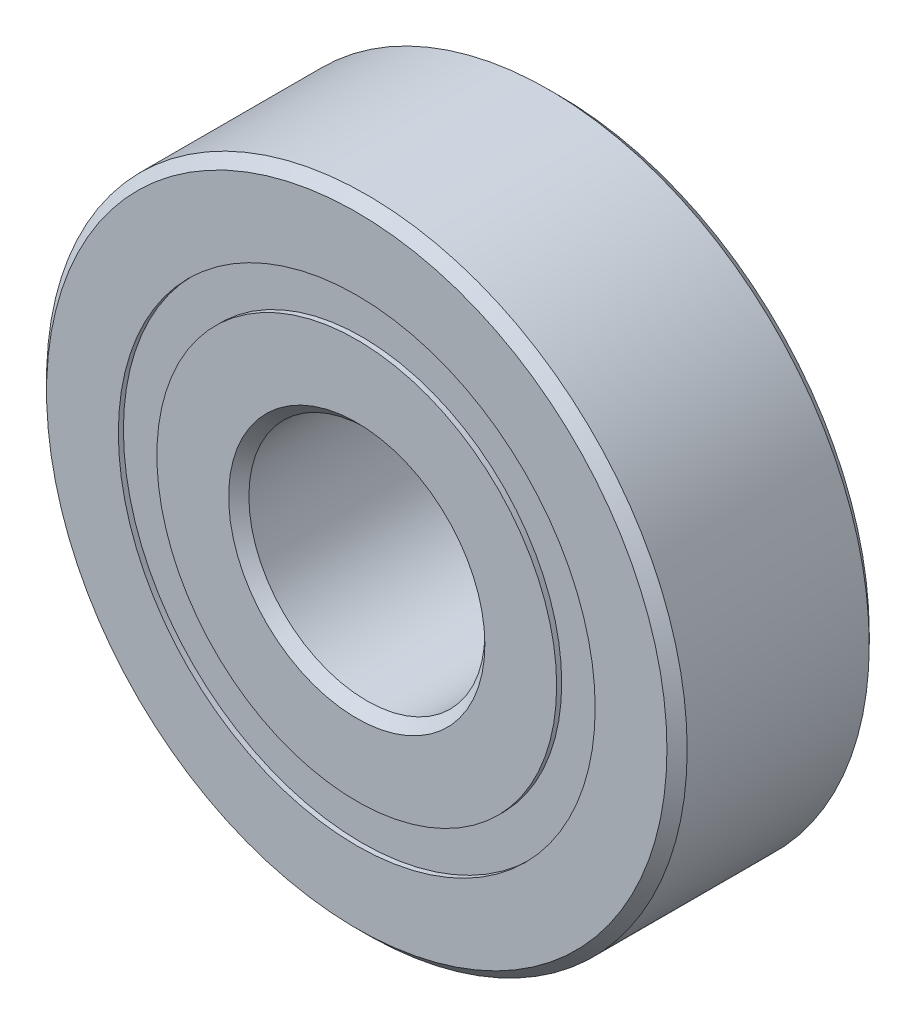
ISO-10303-21;
HEADER;
FILE_DESCRIPTION(('STEP AP214'),'2;1');
FILE_NAME('part.step','',(''),(''),'','','');
FILE_SCHEMA(('AUTOMOTIVE_DESIGN { 1 0 10303 214 1 1 1 1 }'));
ENDSEC;
DATA;
#1=APPLICATION_CONTEXT('core data for automotive mechanical design processes');
#2=APPLICATION_PROTOCOL_DEFINITION('international standard','automotive_design',2000,#1);
#3=PRODUCT_CONTEXT('',#1,'mechanical');
#4=PRODUCT('Part','Part','',(#3));
#5=PRODUCT_RELATED_PRODUCT_CATEGORY('part','',(#4));
#6=PRODUCT_DEFINITION_FORMATION('','',#4);
#7=PRODUCT_DEFINITION_CONTEXT('part definition',#1,'design');
#8=PRODUCT_DEFINITION('design','',#6,#7);
#9=PRODUCT_DEFINITION_SHAPE('','',#8);
#10=(LENGTH_UNIT() NAMED_UNIT(*) SI_UNIT(.MILLI.,.METRE.));
#11=(NAMED_UNIT(*) PLANE_ANGLE_UNIT() SI_UNIT($,.RADIAN.));
#12=(NAMED_UNIT(*) SI_UNIT($,.STERADIAN.) SOLID_ANGLE_UNIT());
#13=UNCERTAINTY_MEASURE_WITH_UNIT(LENGTH_MEASURE(1.E-05),#10,'distance_accuracy_value','');
#14=(GEOMETRIC_REPRESENTATION_CONTEXT(3) GLOBAL_UNCERTAINTY_ASSIGNED_CONTEXT((#13)) GLOBAL_UNIT_ASSIGNED_CONTEXT((#10,
#11,#12)) REPRESENTATION_CONTEXT('',''));
#15=CARTESIAN_POINT('',(0.,0.,0.));
#16=DIRECTION('',(0.,0.,1.));
#17=DIRECTION('',(1.,0.,0.));
#18=AXIS2_PLACEMENT_3D('',#15,#16,#17);
#19=CARTESIAN_POINT('',(-3.24999999999993,5.6291651245989,0.));
#20=DIRECTION('',(0.,0.,1.));
#21=DIRECTION('',(-0.499999999999989,0.866025403784445,0.));
#22=AXIS2_PLACEMENT_3D('',#19,#20,#21);
#23=SPHERICAL_SURFACE('',#22,1.45062344873598);
#24=CARTESIAN_POINT('',(-3.24999999999993,5.6291651245989,1.45062344873598));
#25=VERTEX_POINT('',#24);
#26=VERTEX_LOOP('',#25);
#27=FACE_BOUND('',#26,.T.);
#28=ADVANCED_FACE('F37',(#27),#23,.T.);
#29=CLOSED_SHELL('',(#28));
#30=MANIFOLD_SOLID_BREP('B2',#29);
#31=CARTESIAN_POINT('',(-5.62916512459882,3.25000000000007,0.));
#32=DIRECTION('',(0.,0.,1.));
#33=DIRECTION('',(-0.866025403784433,0.50000000000001,0.));
#34=AXIS2_PLACEMENT_3D('',#31,#32,#33);
#35=SPHERICAL_SURFACE('',#34,1.45062344873598);
#36=CARTESIAN_POINT('',(-5.62916512459882,3.25000000000007,1.45062344873598));
#37=VERTEX_POINT('',#36);
#38=VERTEX_LOOP('',#37);
#39=FACE_BOUND('',#38,.T.);
#40=ADVANCED_FACE('F57',(#39),#35,.T.);
#41=CLOSED_SHELL('',(#40));
#42=MANIFOLD_SOLID_BREP('B6',#41);
#43=CARTESIAN_POINT('',(-6.50000000000001,0.,0.));
#44=DIRECTION('',(0.,0.,1.));
#45=DIRECTION('',(-1.,0.,0.));
#46=AXIS2_PLACEMENT_3D('',#43,#44,#45);
#47=SPHERICAL_SURFACE('',#46,1.45062344873598);
#48=CARTESIAN_POINT('',(-6.50000000000001,0.,1.45062344873598));
#49=VERTEX_POINT('',#48);
#50=VERTEX_LOOP('',#49);
#51=FACE_BOUND('',#50,.T.);
#52=ADVANCED_FACE('F77',(#51),#47,.T.);
#53=CLOSED_SHELL('',(#52));
#54=MANIFOLD_SOLID_BREP('B33',#53);
#55=CARTESIAN_POINT('',(-5.62916512459889,-3.24999999999995,0.));
#56=DIRECTION('',(0.,0.,1.));
#57=DIRECTION('',(-0.866025403784443,-0.499999999999992,0.));
#58=AXIS2_PLACEMENT_3D('',#55,#56,#57);
#59=SPHERICAL_SURFACE('',#58,1.45062344873598);
#60=CARTESIAN_POINT('',(-5.62916512459889,-3.24999999999995,1.45062344873598));
#61=VERTEX_POINT('',#60);
#62=VERTEX_LOOP('',#61);
#63=FACE_BOUND('',#62,.T.);
#64=ADVANCED_FACE('F97',(#63),#59,.T.);
#65=CLOSED_SHELL('',(#64));
#66=MANIFOLD_SOLID_BREP('B53',#65);
#67=CARTESIAN_POINT('',(-3.25000000000005,-5.62916512459883,0.));
#68=DIRECTION('',(0.,0.,1.));
#69=DIRECTION('',(-0.500000000000007,-0.866025403784435,0.));
#70=AXIS2_PLACEMENT_3D('',#67,#68,#69);
#71=SPHERICAL_SURFACE('',#70,1.45062344873598);
#72=CARTESIAN_POINT('',(-3.25000000000005,-5.62916512459883,1.45062344873598));
#73=VERTEX_POINT('',#72);
#74=VERTEX_LOOP('',#73);
#75=FACE_BOUND('',#74,.T.);
#76=ADVANCED_FACE('F117',(#75),#71,.T.);
#77=CLOSED_SHELL('',(#76));
#78=MANIFOLD_SOLID_BREP('B73',#77);
#79=CARTESIAN_POINT('',(0.,-6.50000000000001,0.));
#80=DIRECTION('',(0.,0.,1.));
#81=DIRECTION('',(0.,-1.,0.));
#82=AXIS2_PLACEMENT_3D('',#79,#80,#81);
#83=SPHERICAL_SURFACE('',#82,1.45062344873598);
#84=CARTESIAN_POINT('',(0.,-6.50000000000001,1.45062344873598));
#85=VERTEX_POINT('',#84);
#86=VERTEX_LOOP('',#85);
#87=FACE_BOUND('',#86,.T.);
#88=ADVANCED_FACE('F137',(#87),#83,.T.);
#89=CLOSED_SHELL('',(#88));
#90=MANIFOLD_SOLID_BREP('B93',#89);
#91=CARTESIAN_POINT('',(3.24999999999997,-5.62916512459888,0.));
#92=DIRECTION('',(0.,0.,1.));
#93=DIRECTION('',(0.499999999999995,-0.866025403784442,0.));
#94=AXIS2_PLACEMENT_3D('',#91,#92,#93);
#95=SPHERICAL_SURFACE('',#94,1.45062344873598);
#96=CARTESIAN_POINT('',(3.24999999999997,-5.62916512459888,1.45062344873598));
#97=VERTEX_POINT('',#96);
#98=VERTEX_LOOP('',#97);
#99=FACE_BOUND('',#98,.T.);
#100=ADVANCED_FACE('F157',(#99),#95,.T.);
#101=CLOSED_SHELL('',(#100));
#102=MANIFOLD_SOLID_BREP('B113',#101);
#103=CARTESIAN_POINT('',(5.62916512459884,-3.25000000000003,0.));
#104=DIRECTION('',(0.,0.,1.));
#105=DIRECTION('',(0.866025403784436,-0.500000000000004,0.));
#106=AXIS2_PLACEMENT_3D('',#103,#104,#105);
#107=SPHERICAL_SURFACE('',#106,1.45062344873598);
#108=CARTESIAN_POINT('',(5.62916512459884,-3.25000000000003,1.45062344873598));
#109=VERTEX_POINT('',#108);
#110=VERTEX_LOOP('',#109);
#111=FACE_BOUND('',#110,.T.);
#112=ADVANCED_FACE('F177',(#111),#107,.T.);
#113=CLOSED_SHELL('',(#112));
#114=MANIFOLD_SOLID_BREP('B133',#113);
#115=CARTESIAN_POINT('',(6.50000000000001,0.,0.));
#116=DIRECTION('',(0.,0.,1.));
#117=DIRECTION('',(1.,0.,0.));
#118=AXIS2_PLACEMENT_3D('',#115,#116,#117);
#119=SPHERICAL_SURFACE('',#118,1.45062344873598);
#120=CARTESIAN_POINT('',(6.50000000000001,0.,1.45062344873598));
#121=VERTEX_POINT('',#120);
#122=VERTEX_LOOP('',#121);
#123=FACE_BOUND('',#122,.T.);
#124=ADVANCED_FACE('F197',(#123),#119,.T.);
#125=CLOSED_SHELL('',(#124));
#126=MANIFOLD_SOLID_BREP('B153',#125);
#127=CARTESIAN_POINT('',(5.62916512459886,3.24999999999999,0.));
#128=DIRECTION('',(0.,0.,1.));
#129=DIRECTION('',(0.86602540378444,0.499999999999998,0.));
#130=AXIS2_PLACEMENT_3D('',#127,#128,#129);
#131=SPHERICAL_SURFACE('',#130,1.45062344873598);
#132=CARTESIAN_POINT('',(5.62916512459886,3.24999999999999,1.45062344873598));
#133=VERTEX_POINT('',#132);
#134=VERTEX_LOOP('',#133);
#135=FACE_BOUND('',#134,.T.);
#136=ADVANCED_FACE('F217',(#135),#131,.T.);
#137=CLOSED_SHELL('',(#136));
#138=MANIFOLD_SOLID_BREP('B173',#137);
#139=CARTESIAN_POINT('',(3.25000000000001,5.62916512459885,0.));
#140=DIRECTION('',(0.,0.,1.));
#141=DIRECTION('',(0.500000000000001,0.866025403784438,0.));
#142=AXIS2_PLACEMENT_3D('',#139,#140,#141);
#143=SPHERICAL_SURFACE('',#142,1.45062344873598);
#144=CARTESIAN_POINT('',(3.25000000000001,5.62916512459885,1.45062344873598));
#145=VERTEX_POINT('',#144);
#146=VERTEX_LOOP('',#145);
#147=FACE_BOUND('',#146,.T.);
#148=ADVANCED_FACE('F237',(#147),#143,.T.);
#149=CLOSED_SHELL('',(#148));
#150=MANIFOLD_SOLID_BREP('B193',#149);
#151=CARTESIAN_POINT('',(0.,6.50000000000001,0.));
#152=DIRECTION('',(0.,0.,1.));
#153=DIRECTION('',(0.,1.,0.));
#154=AXIS2_PLACEMENT_3D('',#151,#152,#153);
#155=SPHERICAL_SURFACE('',#154,1.45062344873598);
#156=CARTESIAN_POINT('',(0.,6.50000000000001,1.45062344873598));
#157=VERTEX_POINT('',#156);
#158=VERTEX_LOOP('',#157);
#159=FACE_BOUND('',#158,.T.);
#160=ADVANCED_FACE('F258',(#159),#155,.T.);
#161=CLOSED_SHELL('',(#160));
#162=MANIFOLD_SOLID_BREP('B213',#161);
#163=CARTESIAN_POINT('',(0.,0.,3.));
#164=DIRECTION('',(0.,0.,1.));
#165=DIRECTION('',(1.,0.,0.));
#166=AXIS2_PLACEMENT_3D('',#163,#164,#165);
#167=CYLINDRICAL_SURFACE('',#166,7.07142857142858);
#168=CARTESIAN_POINT('',(0.,0.,-3.));
#169=DIRECTION('',(0.,0.,1.));
#170=DIRECTION('',(1.,0.,0.));
#171=AXIS2_PLACEMENT_3D('',#168,#169,#170);
#172=CIRCLE('',#171,7.07142857142858);
#173=CARTESIAN_POINT('',(7.07142857142858,0.,-3.));
#174=VERTEX_POINT('',#173);
#175=EDGE_CURVE('E310',#174,#174,#172,.T.);
#176=ORIENTED_EDGE('',*,*,#175,.F.);
#177=EDGE_LOOP('',(#176));
#178=FACE_BOUND('',#177,.T.);
#179=CARTESIAN_POINT('',(0.,0.,-2.85));
#180=DIRECTION('',(0.,0.,1.));
#181=DIRECTION('',(1.,0.,0.));
#182=AXIS2_PLACEMENT_3D('',#179,#180,#181);
#183=CIRCLE('',#182,7.07142857142858);
#184=CARTESIAN_POINT('',(7.07142857142858,0.,-2.85));
#185=VERTEX_POINT('',#184);
#186=EDGE_CURVE('E257',#185,#185,#183,.F.);
#187=ORIENTED_EDGE('',*,*,#186,.F.);
#188=EDGE_LOOP('',(#187));
#189=FACE_BOUND('',#188,.T.);
#190=ADVANCED_FACE('F271',(#178,#189),#167,.F.);
#191=CARTESIAN_POINT('',(0.,0.,3.));
#192=DIRECTION('',(0.,0.,1.));
#193=DIRECTION('',(1.,0.,0.));
#194=AXIS2_PLACEMENT_3D('',#191,#192,#193);
#195=CYLINDRICAL_SURFACE('',#194,5.92857142857144);
#196=CARTESIAN_POINT('',(0.,0.,-3.));
#197=DIRECTION('',(0.,0.,1.));
#198=DIRECTION('',(1.,0.,0.));
#199=AXIS2_PLACEMENT_3D('',#196,#197,#198);
#200=CIRCLE('',#199,5.92857142857144);
#201=CARTESIAN_POINT('',(5.92857142857144,0.,-3.));
#202=VERTEX_POINT('',#201);
#203=EDGE_CURVE('E337',#202,#202,#200,.T.);
#204=ORIENTED_EDGE('',*,*,#203,.T.);
#205=EDGE_LOOP('',(#204));
#206=FACE_BOUND('',#205,.T.);
#207=CARTESIAN_POINT('',(0.,0.,-2.85));
#208=DIRECTION('',(0.,0.,1.));
#209=DIRECTION('',(1.,0.,0.));
#210=AXIS2_PLACEMENT_3D('',#207,#208,#209);
#211=CIRCLE('',#210,5.92857142857144);
#212=CARTESIAN_POINT('',(5.92857142857144,0.,-2.85));
#213=VERTEX_POINT('',#212);
#214=EDGE_CURVE('E283',#213,#213,#211,.T.);
#215=ORIENTED_EDGE('',*,*,#214,.F.);
#216=EDGE_LOOP('',(#215));
#217=FACE_BOUND('',#216,.T.);
#218=ADVANCED_FACE('F379',(#206,#217),#195,.T.);
#219=CARTESIAN_POINT('',(0.,0.,3.));
#220=DIRECTION('',(0.,0.,1.));
#221=DIRECTION('',(1.,0.,0.));
#222=AXIS2_PLACEMENT_3D('',#219,#220,#221);
#223=CYLINDRICAL_SURFACE('',#222,7.07142857142858);
#224=CARTESIAN_POINT('',(0.,0.,3.));
#225=DIRECTION('',(0.,0.,1.));
#226=DIRECTION('',(1.,0.,0.));
#227=AXIS2_PLACEMENT_3D('',#224,#225,#226);
#228=CIRCLE('',#227,7.07142857142858);
#229=CARTESIAN_POINT('',(7.07142857142858,0.,3.));
#230=VERTEX_POINT('',#229);
#231=EDGE_CURVE('E301',#230,#230,#228,.T.);
#232=ORIENTED_EDGE('',*,*,#231,.T.);
#233=EDGE_LOOP('',(#232));
#234=FACE_BOUND('',#233,.T.);
#235=CARTESIAN_POINT('',(0.,0.,2.85));
#236=DIRECTION('',(0.,0.,-1.));
#237=DIRECTION('',(-1.,0.,0.));
#238=AXIS2_PLACEMENT_3D('',#235,#236,#237);
#239=CIRCLE('',#238,7.07142857142858);
#240=CARTESIAN_POINT('',(-7.07142857142858,0.,2.85));
#241=VERTEX_POINT('',#240);
#242=EDGE_CURVE('E292',#241,#241,#239,.F.);
#243=ORIENTED_EDGE('',*,*,#242,.F.);
#244=EDGE_LOOP('',(#243));
#245=FACE_BOUND('',#244,.T.);
#246=ADVANCED_FACE('F377',(#234,#245),#223,.F.);
#247=CARTESIAN_POINT('',(0.,0.,2.7));
#248=DIRECTION('',(0.,0.,-1.));
#249=DIRECTION('',(-1.,0.,0.));
#250=AXIS2_PLACEMENT_3D('',#247,#248,#249);
#251=CONICAL_SURFACE('',#250,9.49999999999999,0.785398163397434);
#252=CARTESIAN_POINT('',(0.,0.,3.));
#253=DIRECTION('',(0.,0.,1.));
#254=DIRECTION('',(1.,0.,0.));
#255=AXIS2_PLACEMENT_3D('',#252,#253,#254);
#256=CIRCLE('',#255,9.2);
#257=CARTESIAN_POINT('',(9.2,0.,3.));
#258=VERTEX_POINT('',#257);
#259=EDGE_CURVE('E298',#258,#258,#256,.T.);
#260=ORIENTED_EDGE('',*,*,#259,.F.);
#261=EDGE_LOOP('',(#260));
#262=FACE_BOUND('',#261,.T.);
#263=CARTESIAN_POINT('',(0.,0.,2.7));
#264=DIRECTION('',(0.,0.,1.));
#265=DIRECTION('',(1.,0.,0.));
#266=AXIS2_PLACEMENT_3D('',#263,#264,#265);
#267=CIRCLE('',#266,9.49999999999999);
#268=CARTESIAN_POINT('',(9.49999999999999,0.,2.7));
#269=VERTEX_POINT('',#268);
#270=EDGE_CURVE('E319',#269,#269,#267,.T.);
#271=ORIENTED_EDGE('',*,*,#270,.T.);
#272=EDGE_LOOP('',(#271));
#273=FACE_BOUND('',#272,.T.);
#274=ADVANCED_FACE('F273',(#262,#273),#251,.T.);
#275=CARTESIAN_POINT('',(0.,9.2,3.));
#276=DIRECTION('',(0.,0.,-1.));
#277=DIRECTION('',(-1.,0.,0.));
#278=AXIS2_PLACEMENT_3D('',#275,#276,#277);
#279=PLANE('',#278);
#280=ORIENTED_EDGE('',*,*,#231,.F.);
#281=EDGE_LOOP('',(#280));
#282=FACE_BOUND('',#281,.T.);
#283=ORIENTED_EDGE('',*,*,#259,.T.);
#284=EDGE_LOOP('',(#283));
#285=FACE_BOUND('',#284,.T.);
#286=ADVANCED_FACE('F387',(#282,#285),#279,.F.);
#287=CARTESIAN_POINT('',(0.,9.2,-3.));
#288=DIRECTION('',(0.,0.,1.));
#289=DIRECTION('',(1.,0.,0.));
#290=AXIS2_PLACEMENT_3D('',#287,#288,#289);
#291=PLANE('',#290);
#292=CARTESIAN_POINT('',(0.,0.,-3.));
#293=DIRECTION('',(0.,0.,1.));
#294=DIRECTION('',(1.,0.,0.));
#295=AXIS2_PLACEMENT_3D('',#292,#293,#294);
#296=CIRCLE('',#295,9.2);
#297=CARTESIAN_POINT('',(9.2,0.,-3.));
#298=VERTEX_POINT('',#297);
#299=EDGE_CURVE('E313',#298,#298,#296,.T.);
#300=ORIENTED_EDGE('',*,*,#299,.F.);
#301=EDGE_LOOP('',(#300));
#302=FACE_BOUND('',#301,.T.);
#303=ORIENTED_EDGE('',*,*,#175,.T.);
#304=EDGE_LOOP('',(#303));
#305=FACE_BOUND('',#304,.T.);
#306=ADVANCED_FACE('F449',(#302,#305),#291,.F.);
#307=CARTESIAN_POINT('',(0.,0.,-3.));
#308=DIRECTION('',(0.,0.,1.));
#309=DIRECTION('',(1.,0.,0.));
#310=AXIS2_PLACEMENT_3D('',#307,#308,#309);
#311=CONICAL_SURFACE('',#310,9.2,0.785398163397457);
#312=CARTESIAN_POINT('',(0.,0.,-2.7));
#313=DIRECTION('',(0.,0.,1.));
#314=DIRECTION('',(1.,0.,0.));
#315=AXIS2_PLACEMENT_3D('',#312,#313,#314);
#316=CIRCLE('',#315,9.5);
#317=CARTESIAN_POINT('',(9.5,0.,-2.7));
#318=VERTEX_POINT('',#317);
#319=EDGE_CURVE('E316',#318,#318,#316,.T.);
#320=ORIENTED_EDGE('',*,*,#319,.F.);
#321=EDGE_LOOP('',(#320));
#322=FACE_BOUND('',#321,.T.);
#323=ORIENTED_EDGE('',*,*,#299,.T.);
#324=EDGE_LOOP('',(#323));
#325=FACE_BOUND('',#324,.T.);
#326=ADVANCED_FACE('F446',(#322,#325),#311,.T.);
#327=CARTESIAN_POINT('',(0.,0.,3.));
#328=DIRECTION('',(0.,0.,1.));
#329=DIRECTION('',(1.,0.,0.));
#330=AXIS2_PLACEMENT_3D('',#327,#328,#329);
#331=CYLINDRICAL_SURFACE('',#330,9.49999999999999);
#332=ORIENTED_EDGE('',*,*,#270,.F.);
#333=EDGE_LOOP('',(#332));
#334=FACE_BOUND('',#333,.T.);
#335=ORIENTED_EDGE('',*,*,#319,.T.);
#336=EDGE_LOOP('',(#335));
#337=FACE_BOUND('',#336,.T.);
#338=ADVANCED_FACE('F373',(#334,#337),#331,.T.);
#339=CARTESIAN_POINT('',(0.,7.07142857142858,2.85));
#340=DIRECTION('',(0.,0.,-1.));
#341=DIRECTION('',(-1.,0.,0.));
#342=AXIS2_PLACEMENT_3D('',#339,#340,#341);
#343=PLANE('',#342);
#344=CARTESIAN_POINT('',(0.,0.,2.85));
#345=DIRECTION('',(0.,0.,1.));
#346=DIRECTION('',(1.,0.,0.));
#347=AXIS2_PLACEMENT_3D('',#344,#345,#346);
#348=CIRCLE('',#347,5.92857142857144);
#349=CARTESIAN_POINT('',(5.92857142857144,0.,2.85));
#350=VERTEX_POINT('',#349);
#351=EDGE_CURVE('E322',#350,#350,#348,.T.);
#352=ORIENTED_EDGE('',*,*,#351,.F.);
#353=EDGE_LOOP('',(#352));
#354=FACE_BOUND('',#353,.T.);
#355=ORIENTED_EDGE('',*,*,#242,.T.);
#356=EDGE_LOOP('',(#355));
#357=FACE_BOUND('',#356,.T.);
#358=ADVANCED_FACE('F366',(#354,#357),#343,.F.);
#359=CARTESIAN_POINT('',(0.,0.,3.));
#360=DIRECTION('',(0.,0.,1.));
#361=DIRECTION('',(1.,0.,0.));
#362=AXIS2_PLACEMENT_3D('',#359,#360,#361);
#363=CYLINDRICAL_SURFACE('',#362,5.92857142857144);
#364=CARTESIAN_POINT('',(0.,0.,3.));
#365=DIRECTION('',(0.,0.,1.));
#366=DIRECTION('',(1.,0.,0.));
#367=AXIS2_PLACEMENT_3D('',#364,#365,#366);
#368=CIRCLE('',#367,5.92857142857144);
#369=CARTESIAN_POINT('',(5.92857142857144,0.,3.));
#370=VERTEX_POINT('',#369);
#371=EDGE_CURVE('E346',#370,#370,#368,.T.);
#372=ORIENTED_EDGE('',*,*,#371,.F.);
#373=EDGE_LOOP('',(#372));
#374=FACE_BOUND('',#373,.T.);
#375=ORIENTED_EDGE('',*,*,#351,.T.);
#376=EDGE_LOOP('',(#375));
#377=FACE_BOUND('',#376,.T.);
#378=ADVANCED_FACE('F363',(#374,#377),#363,.T.);
#379=CARTESIAN_POINT('',(0.,0.,3.));
#380=DIRECTION('',(0.,0.,1.));
#381=DIRECTION('',(1.,0.,0.));
#382=AXIS2_PLACEMENT_3D('',#379,#380,#381);
#383=CONICAL_SURFACE('',#382,3.80000000000001,0.785398163397451);
#384=CARTESIAN_POINT('',(0.,0.,2.7));
#385=DIRECTION('',(0.,0.,1.));
#386=DIRECTION('',(1.,0.,0.));
#387=AXIS2_PLACEMENT_3D('',#384,#385,#386);
#388=CIRCLE('',#387,3.50000000000001);
#389=CARTESIAN_POINT('',(3.50000000000001,0.,2.7));
#390=VERTEX_POINT('',#389);
#391=EDGE_CURVE('E328',#390,#390,#388,.T.);
#392=ORIENTED_EDGE('',*,*,#391,.F.);
#393=EDGE_LOOP('',(#392));
#394=FACE_BOUND('',#393,.T.);
#395=CARTESIAN_POINT('',(0.,0.,3.));
#396=DIRECTION('',(0.,0.,1.));
#397=DIRECTION('',(1.,0.,0.));
#398=AXIS2_PLACEMENT_3D('',#395,#396,#397);
#399=CIRCLE('',#398,3.80000000000001);
#400=CARTESIAN_POINT('',(3.80000000000001,0.,3.));
#401=VERTEX_POINT('',#400);
#402=EDGE_CURVE('E349',#401,#401,#399,.T.);
#403=ORIENTED_EDGE('',*,*,#402,.T.);
#404=EDGE_LOOP('',(#403));
#405=FACE_BOUND('',#404,.T.);
#406=ADVANCED_FACE('F353',(#394,#405),#383,.F.);
#407=CARTESIAN_POINT('',(0.,0.,3.));
#408=DIRECTION('',(0.,0.,1.));
#409=DIRECTION('',(1.,0.,0.));
#410=AXIS2_PLACEMENT_3D('',#407,#408,#409);
#411=CYLINDRICAL_SURFACE('',#410,3.50000000000001);
#412=CARTESIAN_POINT('',(0.,0.,-2.7));
#413=DIRECTION('',(0.,0.,1.));
#414=DIRECTION('',(1.,0.,0.));
#415=AXIS2_PLACEMENT_3D('',#412,#413,#414);
#416=CIRCLE('',#415,3.50000000000001);
#417=CARTESIAN_POINT('',(3.50000000000001,0.,-2.7));
#418=VERTEX_POINT('',#417);
#419=EDGE_CURVE('E331',#418,#418,#416,.T.);
#420=ORIENTED_EDGE('',*,*,#419,.F.);
#421=EDGE_LOOP('',(#420));
#422=FACE_BOUND('',#421,.T.);
#423=ORIENTED_EDGE('',*,*,#391,.T.);
#424=EDGE_LOOP('',(#423));
#425=FACE_BOUND('',#424,.T.);
#426=ADVANCED_FACE('F436',(#422,#425),#411,.F.);
#427=CARTESIAN_POINT('',(0.,0.,-2.7));
#428=DIRECTION('',(0.,0.,-1.));
#429=DIRECTION('',(-1.,0.,0.));
#430=AXIS2_PLACEMENT_3D('',#427,#428,#429);
#431=CONICAL_SURFACE('',#430,3.50000000000001,0.785398163397451);
#432=CARTESIAN_POINT('',(0.,0.,-3.));
#433=DIRECTION('',(0.,0.,1.));
#434=DIRECTION('',(1.,0.,0.));
#435=AXIS2_PLACEMENT_3D('',#432,#433,#434);
#436=CIRCLE('',#435,3.80000000000001);
#437=CARTESIAN_POINT('',(3.80000000000001,0.,-3.));
#438=VERTEX_POINT('',#437);
#439=EDGE_CURVE('E334',#438,#438,#436,.T.);
#440=ORIENTED_EDGE('',*,*,#439,.F.);
#441=EDGE_LOOP('',(#440));
#442=FACE_BOUND('',#441,.T.);
#443=ORIENTED_EDGE('',*,*,#419,.T.);
#444=EDGE_LOOP('',(#443));
#445=FACE_BOUND('',#444,.T.);
#446=ADVANCED_FACE('F432',(#442,#445),#431,.F.);
#447=CARTESIAN_POINT('',(0.,3.80000000000001,-3.));
#448=DIRECTION('',(0.,0.,1.));
#449=DIRECTION('',(1.,0.,0.));
#450=AXIS2_PLACEMENT_3D('',#447,#448,#449);
#451=PLANE('',#450);
#452=ORIENTED_EDGE('',*,*,#203,.F.);
#453=EDGE_LOOP('',(#452));
#454=FACE_BOUND('',#453,.T.);
#455=ORIENTED_EDGE('',*,*,#439,.T.);
#456=EDGE_LOOP('',(#455));
#457=FACE_BOUND('',#456,.T.);
#458=ADVANCED_FACE('F359',(#454,#457),#451,.F.);
#459=CARTESIAN_POINT('',(0.,3.80000000000001,3.));
#460=DIRECTION('',(0.,0.,-1.));
#461=DIRECTION('',(-1.,0.,0.));
#462=AXIS2_PLACEMENT_3D('',#459,#460,#461);
#463=PLANE('',#462);
#464=ORIENTED_EDGE('',*,*,#402,.F.);
#465=EDGE_LOOP('',(#464));
#466=FACE_BOUND('',#465,.T.);
#467=ORIENTED_EDGE('',*,*,#371,.T.);
#468=EDGE_LOOP('',(#467));
#469=FACE_BOUND('',#468,.T.);
#470=ADVANCED_FACE('F355',(#466,#469),#463,.F.);
#471=CARTESIAN_POINT('',(0.,7.07142857142858,-2.85));
#472=DIRECTION('',(0.,0.,1.));
#473=DIRECTION('',(1.,0.,0.));
#474=AXIS2_PLACEMENT_3D('',#471,#472,#473);
#475=PLANE('',#474);
#476=ORIENTED_EDGE('',*,*,#186,.T.);
#477=EDGE_LOOP('',(#476));
#478=FACE_BOUND('',#477,.T.);
#479=ORIENTED_EDGE('',*,*,#214,.T.);
#480=EDGE_LOOP('',(#479));
#481=FACE_BOUND('',#480,.T.);
#482=ADVANCED_FACE('F358',(#478,#481),#475,.F.);
#483=CLOSED_SHELL('',(#190,#218,#246,#274,#286,#306,#326,#338,#358,#378,#406,#426,#446,#458,
#470,#482));
#484=CARTESIAN_POINT('',(0.,7.07142857142858,-1.45062344873598));
#485=DIRECTION('',(0.,0.,-1.));
#486=DIRECTION('',(-1.,0.,0.));
#487=AXIS2_PLACEMENT_3D('',#484,#485,#486);
#488=PLANE('',#487);
#489=CARTESIAN_POINT('',(0.,0.,-1.45062344873598));
#490=DIRECTION('',(0.,0.,-1.));
#491=DIRECTION('',(-1.,0.,0.));
#492=AXIS2_PLACEMENT_3D('',#489,#490,#491);
#493=CIRCLE('',#492,5.92857142857144);
#494=CARTESIAN_POINT('',(-5.92857142857144,0.,-1.45062344873598));
#495=VERTEX_POINT('',#494);
#496=EDGE_CURVE('E287',#495,#495,#493,.T.);
#497=ORIENTED_EDGE('',*,*,#496,.T.);
#498=EDGE_LOOP('',(#497));
#499=FACE_BOUND('',#498,.T.);
#500=CARTESIAN_POINT('',(0.,0.,-1.45062344873598));
#501=DIRECTION('',(0.,0.,-1.));
#502=DIRECTION('',(-1.,0.,0.));
#503=AXIS2_PLACEMENT_3D('',#500,#501,#502);
#504=CIRCLE('',#503,7.07142857142858);
#505=CARTESIAN_POINT('',(-7.07142857142858,0.,-1.45062344873598));
#506=VERTEX_POINT('',#505);
#507=EDGE_CURVE('E279',#506,#506,#504,.F.);
#508=ORIENTED_EDGE('',*,*,#507,.T.);
#509=EDGE_LOOP('',(#508));
#510=FACE_BOUND('',#509,.T.);
#511=ADVANCED_FACE('F395',(#499,#510),#488,.F.);
#512=CARTESIAN_POINT('',(0.,0.,1.33333333333333));
#513=DIRECTION('',(0.,0.,1.));
#514=DIRECTION('',(1.,0.,0.));
#515=AXIS2_PLACEMENT_3D('',#512,#513,#514);
#516=CIRCLE('',#515,7.07142857142858);
#517=CARTESIAN_POINT('',(7.07142857142858,0.,1.33333333333333));
#518=VERTEX_POINT('',#517);
#519=EDGE_CURVE('E304',#518,#518,#516,.T.);
#520=ORIENTED_EDGE('',*,*,#519,.F.);
#521=EDGE_LOOP('',(#520));
#522=FACE_BOUND('',#521,.T.);
#523=CARTESIAN_POINT('',(0.,0.,1.45062344873598));
#524=DIRECTION('',(0.,0.,1.));
#525=DIRECTION('',(1.,0.,0.));
#526=AXIS2_PLACEMENT_3D('',#523,#524,#525);
#527=CIRCLE('',#526,7.07142857142858);
#528=CARTESIAN_POINT('',(7.07142857142858,0.,1.45062344873598));
#529=VERTEX_POINT('',#528);
#530=EDGE_CURVE('E295',#529,#529,#527,.F.);
#531=ORIENTED_EDGE('',*,*,#530,.F.);
#532=EDGE_LOOP('',(#531));
#533=FACE_BOUND('',#532,.T.);
#534=ADVANCED_FACE('F382',(#522,#533),#223,.F.);
#535=CARTESIAN_POINT('',(0.,0.,0.));
#536=DIRECTION('',(0.,0.,1.));
#537=DIRECTION('',(1.,0.,0.));
#538=AXIS2_PLACEMENT_3D('',#535,#536,#537);
#539=TOROIDAL_SURFACE('',#538,6.50000000000001,1.45062344873598);
#540=CARTESIAN_POINT('',(0.,0.,-1.33333333333333));
#541=DIRECTION('',(0.,0.,1.));
#542=DIRECTION('',(1.,0.,0.));
#543=AXIS2_PLACEMENT_3D('',#540,#541,#542);
#544=CIRCLE('',#543,7.07142857142858);
#545=CARTESIAN_POINT('',(7.07142857142858,0.,-1.33333333333333));
#546=VERTEX_POINT('',#545);
#547=EDGE_CURVE('E307',#546,#546,#544,.T.);
#548=ORIENTED_EDGE('',*,*,#547,.F.);
#549=EDGE_LOOP('',(#548));
#550=FACE_BOUND('',#549,.T.);
#551=ORIENTED_EDGE('',*,*,#519,.T.);
#552=EDGE_LOOP('',(#551));
#553=FACE_BOUND('',#552,.T.);
#554=ADVANCED_FACE('F394',(#550,#553),#539,.F.);
#555=ORIENTED_EDGE('',*,*,#547,.T.);
#556=EDGE_LOOP('',(#555));
#557=FACE_BOUND('',#556,.T.);
#558=ORIENTED_EDGE('',*,*,#507,.F.);
#559=EDGE_LOOP('',(#558));
#560=FACE_BOUND('',#559,.T.);
#561=ADVANCED_FACE('F401',(#557,#560),#167,.F.);
#562=CARTESIAN_POINT('',(0.,7.07142857142858,1.45062344873598));
#563=DIRECTION('',(0.,0.,1.));
#564=DIRECTION('',(1.,0.,0.));
#565=AXIS2_PLACEMENT_3D('',#562,#563,#564);
#566=PLANE('',#565);
#567=ORIENTED_EDGE('',*,*,#530,.T.);
#568=EDGE_LOOP('',(#567));
#569=FACE_BOUND('',#568,.T.);
#570=CARTESIAN_POINT('',(0.,0.,1.45062344873598));
#571=DIRECTION('',(0.,0.,1.));
#572=DIRECTION('',(1.,0.,0.));
#573=AXIS2_PLACEMENT_3D('',#570,#571,#572);
#574=CIRCLE('',#573,5.92857142857144);
#575=CARTESIAN_POINT('',(5.92857142857144,0.,1.45062344873598));
#576=VERTEX_POINT('',#575);
#577=EDGE_CURVE('E325',#576,#576,#574,.F.);
#578=ORIENTED_EDGE('',*,*,#577,.F.);
#579=EDGE_LOOP('',(#578));
#580=FACE_BOUND('',#579,.T.);
#581=ADVANCED_FACE('F408',(#569,#580),#566,.F.);
#582=CARTESIAN_POINT('',(0.,0.,1.33333333333333));
#583=DIRECTION('',(0.,0.,1.));
#584=DIRECTION('',(1.,0.,0.));
#585=AXIS2_PLACEMENT_3D('',#582,#583,#584);
#586=CIRCLE('',#585,5.92857142857144);
#587=CARTESIAN_POINT('',(5.92857142857144,0.,1.33333333333333));
#588=VERTEX_POINT('',#587);
#589=EDGE_CURVE('E343',#588,#588,#586,.T.);
#590=ORIENTED_EDGE('',*,*,#589,.T.);
#591=EDGE_LOOP('',(#590));
#592=FACE_BOUND('',#591,.T.);
#593=ORIENTED_EDGE('',*,*,#577,.T.);
#594=EDGE_LOOP('',(#593));
#595=FACE_BOUND('',#594,.T.);
#596=ADVANCED_FACE('F368',(#592,#595),#363,.T.);
#597=CARTESIAN_POINT('',(0.,0.,0.));
#598=DIRECTION('',(0.,0.,1.));
#599=DIRECTION('',(1.,0.,0.));
#600=AXIS2_PLACEMENT_3D('',#597,#598,#599);
#601=TOROIDAL_SURFACE('',#600,6.50000000000001,1.45062344873598);
#602=ORIENTED_EDGE('',*,*,#589,.F.);
#603=EDGE_LOOP('',(#602));
#604=FACE_BOUND('',#603,.T.);
#605=CARTESIAN_POINT('',(0.,0.,-1.33333333333333));
#606=DIRECTION('',(0.,0.,1.));
#607=DIRECTION('',(1.,0.,0.));
#608=AXIS2_PLACEMENT_3D('',#605,#606,#607);
#609=CIRCLE('',#608,5.92857142857144);
#610=CARTESIAN_POINT('',(5.92857142857144,0.,-1.33333333333333));
#611=VERTEX_POINT('',#610);
#612=EDGE_CURVE('E340',#611,#611,#609,.T.);
#613=ORIENTED_EDGE('',*,*,#612,.T.);
#614=EDGE_LOOP('',(#613));
#615=FACE_BOUND('',#614,.T.);
#616=ADVANCED_FACE('F426',(#604,#615),#601,.F.);
#617=ORIENTED_EDGE('',*,*,#612,.F.);
#618=EDGE_LOOP('',(#617));
#619=FACE_BOUND('',#618,.T.);
#620=ORIENTED_EDGE('',*,*,#496,.F.);
#621=EDGE_LOOP('',(#620));
#622=FACE_BOUND('',#621,.T.);
#623=ADVANCED_FACE('F391',(#619,#622),#195,.T.);
#624=CLOSED_SHELL('',(#511,#534,#554,#561,#581,#596,#616,#623));
#625=ORIENTED_CLOSED_SHELL('',*,#624,.T.);
#626=BREP_WITH_VOIDS('B233',#483,(#625));
#627=ADVANCED_BREP_SHAPE_REPRESENTATION('',(#18,#30,#42,#54,#66,#78,#90,#102,#114,#126,#138,
#150,#162,#626),#14);
#628=SHAPE_DEFINITION_REPRESENTATION(#9,#627);
ENDSEC;
END-ISO-10303-21;
